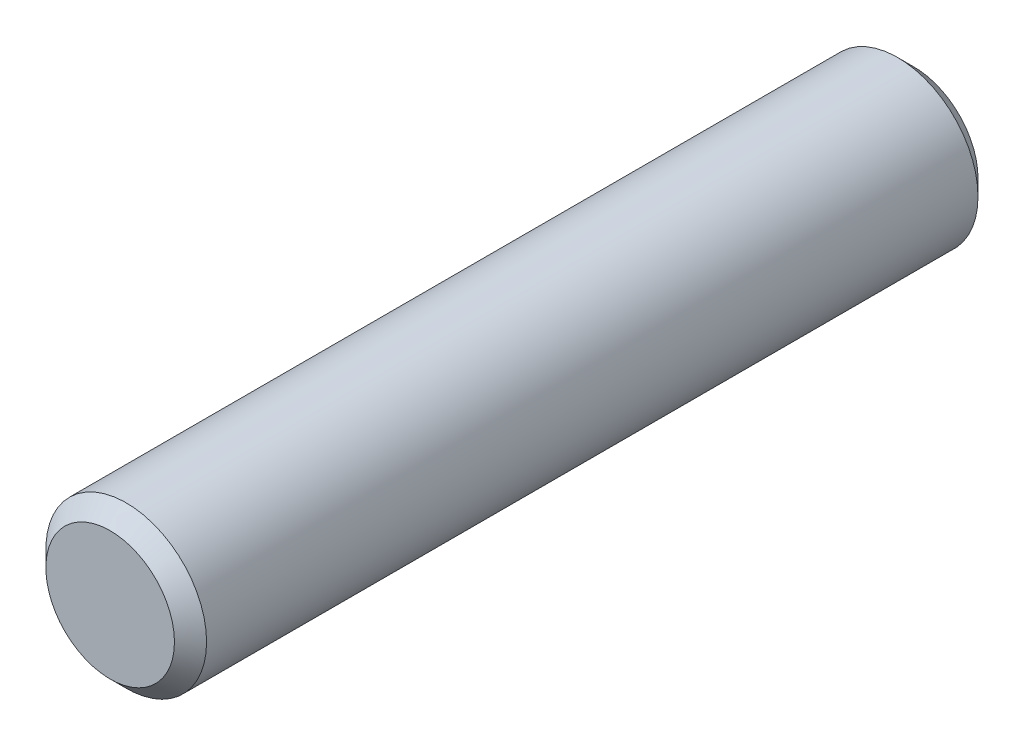
ISO-10303-21;
HEADER;
FILE_DESCRIPTION(('STEP AP214'),'2;1');
FILE_NAME('part.step','',(''),(''),'','','');
FILE_SCHEMA(('AUTOMOTIVE_DESIGN { 1 0 10303 214 1 1 1 1 }'));
ENDSEC;
DATA;
#1=APPLICATION_CONTEXT('core data for automotive mechanical design processes');
#2=APPLICATION_PROTOCOL_DEFINITION('international standard','automotive_design',2000,#1);
#3=PRODUCT_CONTEXT('',#1,'mechanical');
#4=PRODUCT('Part','Part','',(#3));
#5=PRODUCT_RELATED_PRODUCT_CATEGORY('part','',(#4));
#6=PRODUCT_DEFINITION_FORMATION('','',#4);
#7=PRODUCT_DEFINITION_CONTEXT('part definition',#1,'design');
#8=PRODUCT_DEFINITION('design','',#6,#7);
#9=PRODUCT_DEFINITION_SHAPE('','',#8);
#10=(LENGTH_UNIT() NAMED_UNIT(*) SI_UNIT(.MILLI.,.METRE.));
#11=(NAMED_UNIT(*) PLANE_ANGLE_UNIT() SI_UNIT($,.RADIAN.));
#12=(NAMED_UNIT(*) SI_UNIT($,.STERADIAN.) SOLID_ANGLE_UNIT());
#13=UNCERTAINTY_MEASURE_WITH_UNIT(LENGTH_MEASURE(1.E-05),#10,'distance_accuracy_value','');
#14=(GEOMETRIC_REPRESENTATION_CONTEXT(3) GLOBAL_UNCERTAINTY_ASSIGNED_CONTEXT((#13)) GLOBAL_UNIT_ASSIGNED_CONTEXT((#10,
#11,#12)) REPRESENTATION_CONTEXT('',''));
#15=CARTESIAN_POINT('',(0.,0.,0.));
#16=DIRECTION('',(0.,0.,1.));
#17=DIRECTION('',(1.,0.,0.));
#18=AXIS2_PLACEMENT_3D('',#15,#16,#17);
#19=CARTESIAN_POINT('',(0.,0.,5.));
#20=DIRECTION('',(0.,0.,-1.));
#21=DIRECTION('',(-1.,0.,0.));
#22=AXIS2_PLACEMENT_3D('',#19,#20,#21);
#23=CYLINDRICAL_SURFACE('',#22,1.);
#24=CARTESIAN_POINT('',(0.,0.,-4.8));
#25=DIRECTION('',(0.,0.,1.));
#26=DIRECTION('',(1.,0.,0.));
#27=AXIS2_PLACEMENT_3D('',#24,#25,#26);
#28=CIRCLE('',#27,1.);
#29=CARTESIAN_POINT('',(1.,0.,-4.8));
#30=VERTEX_POINT('',#29);
#31=EDGE_CURVE('E45',#30,#30,#28,.T.);
#32=ORIENTED_EDGE('',*,*,#31,.T.);
#33=EDGE_LOOP('',(#32));
#34=FACE_BOUND('',#33,.T.);
#35=CARTESIAN_POINT('',(0.,0.,4.8));
#36=DIRECTION('',(0.,0.,1.));
#37=DIRECTION('',(1.,0.,0.));
#38=AXIS2_PLACEMENT_3D('',#35,#36,#37);
#39=CIRCLE('',#38,1.);
#40=CARTESIAN_POINT('',(1.,0.,4.8));
#41=VERTEX_POINT('',#40);
#42=EDGE_CURVE('E49',#41,#41,#39,.F.);
#43=ORIENTED_EDGE('',*,*,#42,.T.);
#44=EDGE_LOOP('',(#43));
#45=FACE_BOUND('',#44,.T.);
#46=ADVANCED_FACE('F33',(#34,#45),#23,.T.);
#47=CARTESIAN_POINT('',(0.,0.,5.));
#48=DIRECTION('',(0.,0.,1.));
#49=DIRECTION('',(1.,0.,0.));
#50=AXIS2_PLACEMENT_3D('',#47,#48,#49);
#51=PLANE('',#50);
#52=CARTESIAN_POINT('',(0.,0.,5.));
#53=DIRECTION('',(0.,0.,1.));
#54=DIRECTION('',(1.,0.,0.));
#55=AXIS2_PLACEMENT_3D('',#52,#53,#54);
#56=CIRCLE('',#55,0.8);
#57=CARTESIAN_POINT('',(0.8,0.,5.));
#58=VERTEX_POINT('',#57);
#59=EDGE_CURVE('E10',#58,#58,#56,.T.);
#60=ORIENTED_EDGE('',*,*,#59,.T.);
#61=EDGE_LOOP('',(#60));
#62=FACE_BOUND('',#61,.T.);
#63=ADVANCED_FACE('F65',(#62),#51,.T.);
#64=CARTESIAN_POINT('',(0.,0.,-5.));
#65=DIRECTION('',(0.,0.,1.));
#66=DIRECTION('',(1.,0.,0.));
#67=AXIS2_PLACEMENT_3D('',#64,#65,#66);
#68=PLANE('',#67);
#69=CARTESIAN_POINT('',(0.,0.,-5.));
#70=DIRECTION('',(0.,0.,1.));
#71=DIRECTION('',(1.,0.,0.));
#72=AXIS2_PLACEMENT_3D('',#69,#70,#71);
#73=CIRCLE('',#72,0.799999999999998);
#74=CARTESIAN_POINT('',(0.799999999999998,0.,-5.));
#75=VERTEX_POINT('',#74);
#76=EDGE_CURVE('E41',#75,#75,#73,.F.);
#77=ORIENTED_EDGE('',*,*,#76,.T.);
#78=EDGE_LOOP('',(#77));
#79=FACE_BOUND('',#78,.T.);
#80=ADVANCED_FACE('F62',(#79),#68,.F.);
#81=CARTESIAN_POINT('',(0.,0.,-4.8));
#82=DIRECTION('',(0.,0.,1.));
#83=DIRECTION('',(1.,0.,0.));
#84=AXIS2_PLACEMENT_3D('',#81,#82,#83);
#85=CONICAL_SURFACE('',#84,1.,0.785398163397453);
#86=ORIENTED_EDGE('',*,*,#76,.F.);
#87=EDGE_LOOP('',(#86));
#88=FACE_BOUND('',#87,.T.);
#89=ORIENTED_EDGE('',*,*,#31,.F.);
#90=EDGE_LOOP('',(#89));
#91=FACE_BOUND('',#90,.T.);
#92=ADVANCED_FACE('F58',(#88,#91),#85,.T.);
#93=CARTESIAN_POINT('',(0.,0.,5.));
#94=DIRECTION('',(0.,0.,-1.));
#95=DIRECTION('',(-1.,0.,0.));
#96=AXIS2_PLACEMENT_3D('',#93,#94,#95);
#97=CONICAL_SURFACE('',#96,0.8,0.785398163397448);
#98=ORIENTED_EDGE('',*,*,#42,.F.);
#99=EDGE_LOOP('',(#98));
#100=FACE_BOUND('',#99,.T.);
#101=ORIENTED_EDGE('',*,*,#59,.F.);
#102=EDGE_LOOP('',(#101));
#103=FACE_BOUND('',#102,.T.);
#104=ADVANCED_FACE('F36',(#100,#103),#97,.T.);
#105=CLOSED_SHELL('',(#46,#63,#80,#92,#104));
#106=MANIFOLD_SOLID_BREP('B2',#105);
#107=ADVANCED_BREP_SHAPE_REPRESENTATION('',(#18,#106),#14);
#108=SHAPE_DEFINITION_REPRESENTATION(#9,#107);
ENDSEC;
END-ISO-10303-21;
